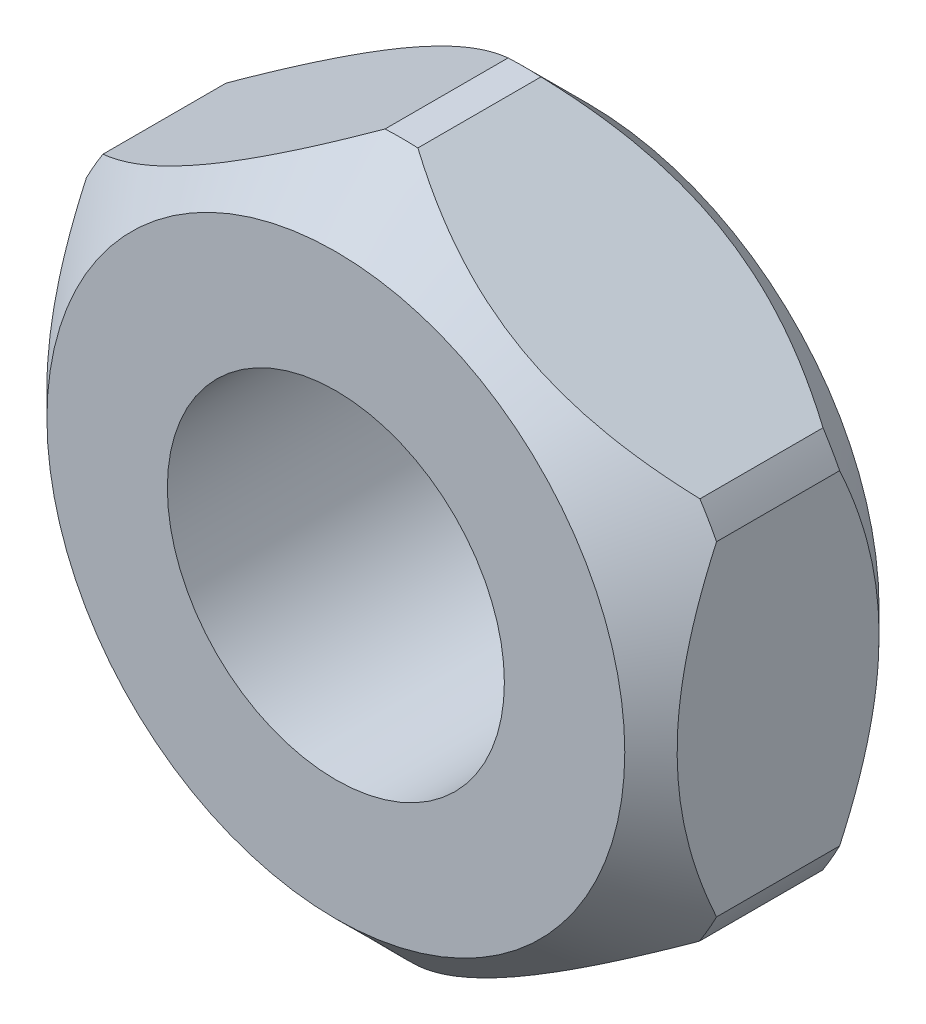
ISO-10303-21;
HEADER;
FILE_DESCRIPTION(('STEP AP214'),'2;1');
FILE_NAME('part.step','',(''),(''),'','','');
FILE_SCHEMA(('AUTOMOTIVE_DESIGN { 1 0 10303 214 1 1 1 1 }'));
ENDSEC;
DATA;
#1=APPLICATION_CONTEXT('core data for automotive mechanical design processes');
#2=APPLICATION_PROTOCOL_DEFINITION('international standard','automotive_design',2000,#1);
#3=PRODUCT_CONTEXT('',#1,'mechanical');
#4=PRODUCT('Part','Part','',(#3));
#5=PRODUCT_RELATED_PRODUCT_CATEGORY('part','',(#4));
#6=PRODUCT_DEFINITION_FORMATION('','',#4);
#7=PRODUCT_DEFINITION_CONTEXT('part definition',#1,'design');
#8=PRODUCT_DEFINITION('design','',#6,#7);
#9=PRODUCT_DEFINITION_SHAPE('','',#8);
#10=(LENGTH_UNIT() NAMED_UNIT(*) SI_UNIT(.MILLI.,.METRE.));
#11=(NAMED_UNIT(*) PLANE_ANGLE_UNIT() SI_UNIT($,.RADIAN.));
#12=(NAMED_UNIT(*) SI_UNIT($,.STERADIAN.) SOLID_ANGLE_UNIT());
#13=UNCERTAINTY_MEASURE_WITH_UNIT(LENGTH_MEASURE(1.E-05),#10,'distance_accuracy_value','');
#14=(GEOMETRIC_REPRESENTATION_CONTEXT(3) GLOBAL_UNCERTAINTY_ASSIGNED_CONTEXT((#13)) GLOBAL_UNIT_ASSIGNED_CONTEXT((#10,
#11,#12)) REPRESENTATION_CONTEXT('',''));
#15=CARTESIAN_POINT('',(0.,0.,0.));
#16=DIRECTION('',(0.,0.,1.));
#17=DIRECTION('',(1.,0.,0.));
#18=AXIS2_PLACEMENT_3D('',#15,#16,#17);
#19=CARTESIAN_POINT('',(-2.54001186026356E-13,-4.00486071307779E-12,-4.0504886494919));
#20=DIRECTION('',(0.,0.,1.));
#21=DIRECTION('',(1.,0.,0.));
#22=AXIS2_PLACEMENT_3D('',#19,#20,#21);
#23=CYLINDRICAL_SURFACE('',#22,7.14438473884469);
#24=DIRECTION('',(0.,0.,-1.));
#25=VECTOR('',#24,1.);
#26=CARTESIAN_POINT('',(0.347952146944708,-7.13590657170695,-2.56216466532603));
#27=LINE('',#26,#25);
#28=CARTESIAN_POINT('',(0.347952146944708,-7.13590657170695,-1.32189467852113));
#29=VERTEX_POINT('',#28);
#30=CARTESIAN_POINT('',(0.347952146944708,-7.13590657170695,-3.80243465213093));
#31=VERTEX_POINT('',#30);
#32=EDGE_CURVE('E112',#29,#31,#27,.T.);
#33=ORIENTED_EDGE('',*,*,#32,.F.);
#34=CARTESIAN_POINT('',(-2.54001186026356E-13,-4.00486071307779E-12,-1.32189467852113));
#35=DIRECTION('',(0.,0.,-1.));
#36=DIRECTION('',(-1.,0.,0.));
#37=AXIS2_PLACEMENT_3D('',#34,#35,#36);
#38=CIRCLE('',#37,7.14438473884469);
#39=CARTESIAN_POINT('',(-0.347952146945216,-7.13590657170695,-1.32189467852114));
#40=VERTEX_POINT('',#39);
#41=EDGE_CURVE('E107',#29,#40,#38,.T.);
#42=ORIENTED_EDGE('',*,*,#41,.T.);
#43=DIRECTION('',(0.,0.,1.));
#44=VECTOR('',#43,1.);
#45=CARTESIAN_POINT('',(-0.347952146945216,-7.13590657170695,-2.56216466532603));
#46=LINE('',#45,#44);
#47=CARTESIAN_POINT('',(-0.347952146945216,-7.13590657170695,-3.80243465213092));
#48=VERTEX_POINT('',#47);
#49=EDGE_CURVE('E109',#48,#40,#46,.T.);
#50=ORIENTED_EDGE('',*,*,#49,.F.);
#51=CARTESIAN_POINT('',(-2.54001186026356E-13,-4.00486071307779E-12,-3.8024346521312));
#52=DIRECTION('',(0.,0.,1.));
#53=DIRECTION('',(0.,-1.,0.));
#54=AXIS2_PLACEMENT_3D('',#51,#52,#53);
#55=CIRCLE('',#54,7.14438473884469);
#56=EDGE_CURVE('E118',#48,#31,#55,.T.);
#57=ORIENTED_EDGE('',*,*,#56,.T.);
#58=EDGE_LOOP('',(#33,#42,#50,#57));
#59=FACE_BOUND('',#58,.T.);
#60=ADVANCED_FACE('F16',(#59),#23,.T.);
#61=CARTESIAN_POINT('',(-2.24698515849874E-11,-1.11931775502268E-11,-4.0504886494919));
#62=DIRECTION('',(0.,0.,1.));
#63=DIRECTION('',(1.,0.,0.));
#64=AXIS2_PLACEMENT_3D('',#61,#62,#63);
#65=CYLINDRICAL_SURFACE('',#64,7.14438473882359);
#66=DIRECTION('',(0.,0.,-1.));
#67=VECTOR('',#66,1.);
#68=CARTESIAN_POINT('',(-6.0059002966524,-3.86928868441782,-2.56216466532603));
#69=LINE('',#68,#67);
#70=CARTESIAN_POINT('',(-6.00590029665232,-3.86928868441787,-1.3218946785211));
#71=VERTEX_POINT('',#70);
#72=CARTESIAN_POINT('',(-6.00590029665232,-3.86928868441787,-3.80243465213096));
#73=VERTEX_POINT('',#72);
#74=EDGE_CURVE('E126',#71,#73,#69,.T.);
#75=ORIENTED_EDGE('',*,*,#74,.F.);
#76=CARTESIAN_POINT('',(-2.24698515849874E-11,-1.11931775502268E-11,-1.32189467852113));
#77=DIRECTION('',(0.,0.,-1.));
#78=DIRECTION('',(-1.,0.,0.));
#79=AXIS2_PLACEMENT_3D('',#76,#77,#78);
#80=CIRCLE('',#79,7.14438473882359);
#81=CARTESIAN_POINT('',(-6.35,-3.2741003797522,-1.32189467852109));
#82=VERTEX_POINT('',#81);
#83=EDGE_CURVE('E133',#71,#82,#80,.T.);
#84=ORIENTED_EDGE('',*,*,#83,.T.);
#85=DIRECTION('',(0.,0.,1.));
#86=VECTOR('',#85,1.);
#87=CARTESIAN_POINT('',(-6.35,-3.27410037975211,-2.56216466532616));
#88=LINE('',#87,#86);
#89=CARTESIAN_POINT('',(-6.35,-3.2741003797522,-3.80243465213097));
#90=VERTEX_POINT('',#89);
#91=EDGE_CURVE('E162',#90,#82,#88,.T.);
#92=ORIENTED_EDGE('',*,*,#91,.F.);
#93=CARTESIAN_POINT('',(-2.24698515849874E-11,-1.11931775502268E-11,-3.80243465213121));
#94=DIRECTION('',(0.,0.,1.));
#95=DIRECTION('',(1.,0.,0.));
#96=AXIS2_PLACEMENT_3D('',#93,#94,#95);
#97=CIRCLE('',#96,7.14438473882359);
#98=EDGE_CURVE('E117',#90,#73,#97,.T.);
#99=ORIENTED_EDGE('',*,*,#98,.T.);
#100=EDGE_LOOP('',(#75,#84,#92,#99));
#101=FACE_BOUND('',#100,.T.);
#102=ADVANCED_FACE('F302',(#101),#65,.T.);
#103=CARTESIAN_POINT('',(-5.41875078794183E-11,3.08629339820814E-11,-4.0504886494919));
#104=DIRECTION('',(0.,0.,1.));
#105=DIRECTION('',(1.,0.,0.));
#106=AXIS2_PLACEMENT_3D('',#103,#104,#105);
#107=CYLINDRICAL_SURFACE('',#106,7.14438473878634);
#108=DIRECTION('',(0.,0.,-1.));
#109=VECTOR('',#108,1.);
#110=CARTESIAN_POINT('',(-6.35,3.27410037975211,-2.56216466532616));
#111=LINE('',#110,#109);
#112=CARTESIAN_POINT('',(-6.35,3.27410037975215,-1.32189467852109));
#113=VERTEX_POINT('',#112);
#114=CARTESIAN_POINT('',(-6.35,3.27410037975215,-3.80243465213097));
#115=VERTEX_POINT('',#114);
#116=EDGE_CURVE('E159',#113,#115,#111,.T.);
#117=ORIENTED_EDGE('',*,*,#116,.F.);
#118=CARTESIAN_POINT('',(-5.41875078794183E-11,3.08629339820814E-11,-1.32189467852113));
#119=DIRECTION('',(0.,0.,-1.));
#120=DIRECTION('',(-1.,0.,0.));
#121=AXIS2_PLACEMENT_3D('',#118,#119,#120);
#122=CIRCLE('',#121,7.14438473878634);
#123=CARTESIAN_POINT('',(-6.01498921798223,3.85514435582517,-1.32189467852111));
#124=VERTEX_POINT('',#123);
#125=EDGE_CURVE('E182',#113,#124,#122,.T.);
#126=ORIENTED_EDGE('',*,*,#125,.T.);
#127=DIRECTION('',(0.,0.,1.));
#128=VECTOR('',#127,1.);
#129=CARTESIAN_POINT('',(-6.01498921798227,3.85514435582515,-2.56216466532603));
#130=LINE('',#129,#128);
#131=CARTESIAN_POINT('',(-6.01498921798223,3.85514435582517,-3.80243465213095));
#132=VERTEX_POINT('',#131);
#133=EDGE_CURVE('E156',#132,#124,#130,.T.);
#134=ORIENTED_EDGE('',*,*,#133,.F.);
#135=CARTESIAN_POINT('',(-5.41875078794183E-11,3.08629339820814E-11,-3.80243465213122));
#136=DIRECTION('',(0.,0.,1.));
#137=DIRECTION('',(1.,0.,0.));
#138=AXIS2_PLACEMENT_3D('',#135,#136,#137);
#139=CIRCLE('',#138,7.14438473878634);
#140=EDGE_CURVE('E183',#132,#115,#139,.T.);
#141=ORIENTED_EDGE('',*,*,#140,.T.);
#142=EDGE_LOOP('',(#117,#126,#134,#141));
#143=FACE_BOUND('',#142,.T.);
#144=ADVANCED_FACE('F309',(#143),#107,.T.);
#145=CARTESIAN_POINT('',(-3.53161261901163E-12,-5.55590515796998E-11,-4.0504886494919));
#146=DIRECTION('',(0.,0.,1.));
#147=DIRECTION('',(1.,0.,0.));
#148=AXIS2_PLACEMENT_3D('',#145,#146,#147);
#149=CYLINDRICAL_SURFACE('',#148,7.14438473890418);
#150=DIRECTION('',(0.,0.,1.));
#151=VECTOR('',#150,1.);
#152=CARTESIAN_POINT('',(0.331158338410472,7.1367056441746,-2.56216466532603));
#153=LINE('',#152,#151);
#154=CARTESIAN_POINT('',(0.331158338410524,7.13670564417457,-3.80243465213099));
#155=VERTEX_POINT('',#154);
#156=CARTESIAN_POINT('',(0.331158338410524,7.13670564417457,-1.32189467852107));
#157=VERTEX_POINT('',#156);
#158=EDGE_CURVE('E150',#155,#157,#153,.T.);
#159=ORIENTED_EDGE('',*,*,#158,.F.);
#160=CARTESIAN_POINT('',(-3.53161261901163E-12,-5.55590515796998E-11,-3.80243465213093));
#161=DIRECTION('',(0.,0.,1.));
#162=DIRECTION('',(1.,0.,0.));
#163=AXIS2_PLACEMENT_3D('',#160,#161,#162);
#164=CIRCLE('',#163,7.14438473890418);
#165=CARTESIAN_POINT('',(-0.33115833840942,7.13670564417476,-3.802434652131));
#166=VERTEX_POINT('',#165);
#167=EDGE_CURVE('E177',#155,#166,#164,.T.);
#168=ORIENTED_EDGE('',*,*,#167,.T.);
#169=DIRECTION('',(0.,0.,-1.));
#170=VECTOR('',#169,1.);
#171=CARTESIAN_POINT('',(-0.33115833840971,7.1367056441746,-2.56216466532603));
#172=LINE('',#171,#170);
#173=CARTESIAN_POINT('',(-0.33115833840942,7.13670564417476,-1.32189467852106));
#174=VERTEX_POINT('',#173);
#175=EDGE_CURVE('E153',#174,#166,#172,.T.);
#176=ORIENTED_EDGE('',*,*,#175,.F.);
#177=CARTESIAN_POINT('',(-3.53161261901163E-12,-5.55590515796998E-11,-1.32189467852113));
#178=DIRECTION('',(0.,0.,-1.));
#179=DIRECTION('',(-1.,0.,0.));
#180=AXIS2_PLACEMENT_3D('',#177,#178,#179);
#181=CIRCLE('',#180,7.14438473890418);
#182=EDGE_CURVE('E180',#174,#157,#181,.T.);
#183=ORIENTED_EDGE('',*,*,#182,.T.);
#184=EDGE_LOOP('',(#159,#168,#176,#183));
#185=FACE_BOUND('',#184,.T.);
#186=ADVANCED_FACE('F313',(#185),#149,.T.);
#187=CARTESIAN_POINT('',(-4.79247923304912E-11,-2.41915466354443E-11,-4.0504886494919));
#188=DIRECTION('',(0.,0.,1.));
#189=DIRECTION('',(1.,0.,0.));
#190=AXIS2_PLACEMENT_3D('',#187,#188,#189);
#191=CYLINDRICAL_SURFACE('',#190,7.14438473890218);
#192=DIRECTION('',(0.,0.,-1.));
#193=VECTOR('',#192,1.);
#194=CARTESIAN_POINT('',(6.01498921797642,3.8551443558343,-2.56216466532603));
#195=LINE('',#194,#193);
#196=CARTESIAN_POINT('',(6.01498921797653,3.85514435583424,-1.32189467852112));
#197=VERTEX_POINT('',#196);
#198=CARTESIAN_POINT('',(6.01498921797653,3.85514435583424,-3.80243465213094));
#199=VERTEX_POINT('',#198);
#200=EDGE_CURVE('E145',#197,#199,#195,.T.);
#201=ORIENTED_EDGE('',*,*,#200,.F.);
#202=CARTESIAN_POINT('',(-4.79247923304912E-11,-2.41915466354443E-11,-1.32189467852113));
#203=DIRECTION('',(0.,0.,-1.));
#204=DIRECTION('',(-1.,0.,0.));
#205=AXIS2_PLACEMENT_3D('',#202,#203,#204);
#206=CIRCLE('',#205,7.14438473890218);
#207=CARTESIAN_POINT('',(6.35,3.27410037975199,-1.32189467852109));
#208=VERTEX_POINT('',#207);
#209=EDGE_CURVE('E175',#197,#208,#206,.T.);
#210=ORIENTED_EDGE('',*,*,#209,.T.);
#211=DIRECTION('',(0.,0.,1.));
#212=VECTOR('',#211,1.);
#213=CARTESIAN_POINT('',(6.35,3.27410037975211,-2.56216466532616));
#214=LINE('',#213,#212);
#215=CARTESIAN_POINT('',(6.35,3.27410037975199,-3.80243465213097));
#216=VERTEX_POINT('',#215);
#217=EDGE_CURVE('E139',#216,#208,#214,.T.);
#218=ORIENTED_EDGE('',*,*,#217,.F.);
#219=CARTESIAN_POINT('',(-4.79247923304912E-11,-2.41915466354443E-11,-3.80243465213093));
#220=DIRECTION('',(0.,0.,1.));
#221=DIRECTION('',(1.,0.,0.));
#222=AXIS2_PLACEMENT_3D('',#219,#220,#221);
#223=CIRCLE('',#222,7.14438473890218);
#224=EDGE_CURVE('E40',#216,#199,#223,.T.);
#225=ORIENTED_EDGE('',*,*,#224,.T.);
#226=EDGE_LOOP('',(#201,#210,#218,#225));
#227=FACE_BOUND('',#226,.T.);
#228=ADVANCED_FACE('F296',(#227),#191,.T.);
#229=CARTESIAN_POINT('',(-8.33117530007804E-12,6.14964183854547E-12,-4.0504886494919));
#230=DIRECTION('',(0.,0.,1.));
#231=DIRECTION('',(1.,0.,0.));
#232=AXIS2_PLACEMENT_3D('',#229,#230,#231);
#233=CYLINDRICAL_SURFACE('',#232,7.14438473885894);
#234=DIRECTION('',(0.,0.,-1.));
#235=VECTOR('',#234,1.);
#236=CARTESIAN_POINT('',(6.35,-3.27410037975236,-2.56216466532616));
#237=LINE('',#236,#235);
#238=CARTESIAN_POINT('',(6.35,-3.27410037975236,-1.32189467852115));
#239=VERTEX_POINT('',#238);
#240=CARTESIAN_POINT('',(6.35,-3.27410037975236,-3.80243465213091));
#241=VERTEX_POINT('',#240);
#242=EDGE_CURVE('E136',#239,#241,#237,.T.);
#243=ORIENTED_EDGE('',*,*,#242,.F.);
#244=CARTESIAN_POINT('',(-8.33117530007804E-12,6.14964183854547E-12,-1.32189467852113));
#245=DIRECTION('',(0.,0.,-1.));
#246=DIRECTION('',(-1.,0.,0.));
#247=AXIS2_PLACEMENT_3D('',#244,#245,#246);
#248=CIRCLE('',#247,7.14438473885894);
#249=CARTESIAN_POINT('',(6.00590029665813,-3.86928868440899,-1.32189467852115));
#250=VERTEX_POINT('',#249);
#251=EDGE_CURVE('E170',#239,#250,#248,.T.);
#252=ORIENTED_EDGE('',*,*,#251,.T.);
#253=DIRECTION('',(0.,0.,1.));
#254=VECTOR('',#253,1.);
#255=CARTESIAN_POINT('',(6.00590029665824,-3.86928868440893,-2.56216466532603));
#256=LINE('',#255,#254);
#257=CARTESIAN_POINT('',(6.00590029665813,-3.86928868440899,-3.80243465213091));
#258=VERTEX_POINT('',#257);
#259=EDGE_CURVE('E167',#258,#250,#256,.T.);
#260=ORIENTED_EDGE('',*,*,#259,.F.);
#261=CARTESIAN_POINT('',(-8.33117530007804E-12,6.14964183854547E-12,-3.80243465213065));
#262=DIRECTION('',(0.,0.,1.));
#263=DIRECTION('',(1.,0.,0.));
#264=AXIS2_PLACEMENT_3D('',#261,#262,#263);
#265=CIRCLE('',#264,7.14438473885894);
#266=EDGE_CURVE('E172',#258,#241,#265,.T.);
#267=ORIENTED_EDGE('',*,*,#266,.T.);
#268=EDGE_LOOP('',(#243,#252,#260,#267));
#269=FACE_BOUND('',#268,.T.);
#270=ADVANCED_FACE('F241',(#269),#233,.T.);
#271=CARTESIAN_POINT('',(0.347952146944708,-7.13590657170695,-4.65936090946275));
#272=DIRECTION('',(0.499999999999997,-0.866025403784441,0.));
#273=DIRECTION('',(0.866025403784441,0.499999999999997,0.));
#274=AXIS2_PLACEMENT_3D('',#271,#272,#273);
#275=PLANE('',#274);
#276=ORIENTED_EDGE('',*,*,#32,.T.);
#277=CARTESIAN_POINT('',(6.00590029665825,-3.86928868440893,-3.80243465213089));
#278=CARTESIAN_POINT('',(5.80644449967036,-3.98444454249131,-3.90770247960772));
#279=CARTESIAN_POINT('',(5.60385786196578,-4.10140799230428,-4.0058942073424));
#280=CARTESIAN_POINT('',(5.19183579420594,-4.33928904403748,-4.18400909526314));
#281=CARTESIAN_POINT('',(4.98237538970745,-4.46022106495926,-4.26385459830314));
#282=CARTESIAN_POINT('',(4.56040344685427,-4.703846679756,-4.3993362422309));
#283=CARTESIAN_POINT('',(4.347965428369,-4.82649782691458,-4.45526956910966));
#284=CARTESIAN_POINT('',(3.91934303659074,-5.07396308018846,-4.54001603066456));
#285=CARTESIAN_POINT('',(3.70316570596371,-5.19877312021867,-4.56887546886592));
#286=CARTESIAN_POINT('',(3.28621233899616,-5.4395012588769,-4.59590188901952));
#287=CARTESIAN_POINT('',(3.08554446084284,-5.55535691234643,-4.59627902924287));
#288=CARTESIAN_POINT('',(2.68527896860236,-5.78645030203879,-4.57183446254958));
#289=CARTESIAN_POINT('',(2.48568197517419,-5.90168767992398,-4.54699945807256));
#290=CARTESIAN_POINT('',(2.08977359237391,-6.13026549130815,-4.47408360389368));
#291=CARTESIAN_POINT('',(1.89346222333125,-6.24360591306992,-4.42600261041476));
#292=CARTESIAN_POINT('',(1.50533134872441,-6.46769337800497,-4.30978956376296));
#293=CARTESIAN_POINT('',(1.31351367590617,-6.57843936304191,-4.24164947809793));
#294=CARTESIAN_POINT('',(0.99217881056966,-6.76396213404396,-4.11197098711162));
#295=CARTESIAN_POINT('',(0.861351786406531,-6.83949515166182,-4.0546602141036));
#296=CARTESIAN_POINT('',(0.602613131566253,-6.98887798368361,-3.93332877512898));
#297=CARTESIAN_POINT('',(0.47469245110724,-7.06273302298154,-3.86933391803887));
#298=CARTESIAN_POINT('',(0.347952146944723,-7.13590657170695,-3.80243465213094));
#299=B_SPLINE_CURVE_WITH_KNOTS('',3,(#277,#278,#279,#280,#281,#282,#283,#284,#285,#286,#287,
#288,#289,#290,#291,#292,#293,#294,#295,#296,#297,#298),.UNSPECIFIED.,.F.,.F.,(4,2,2,2,2,2,2,2,
2,2,4),(0.,0.760090379563456,1.52334116749001,2.27680898244764,3.02898580583094,
3.72273033691908,4.41684095765001,5.11095587152894,5.8053491167717,6.28990118718948,
6.77264699064844),.UNSPECIFIED.);
#300=EDGE_CURVE('E248',#258,#31,#299,.T.);
#301=ORIENTED_EDGE('',*,*,#300,.F.);
#302=ORIENTED_EDGE('',*,*,#259,.T.);
#303=CARTESIAN_POINT('',(0.347952146944714,-7.13590657170695,-1.32189467852112));
#304=CARTESIAN_POINT('',(0.547407943932592,-7.02075071362457,-1.21662685104429));
#305=CARTESIAN_POINT('',(0.749994581637169,-6.90378726381161,-1.11843512330962));
#306=CARTESIAN_POINT('',(1.162016649397,-6.66590621207841,-0.940320235388892));
#307=CARTESIAN_POINT('',(1.37147705389549,-6.54497419115664,-0.8604747323489));
#308=CARTESIAN_POINT('',(1.79344899674866,-6.3013485763599,-0.724993088421149));
#309=CARTESIAN_POINT('',(2.00588701523392,-6.17869742920132,-0.669059761542392));
#310=CARTESIAN_POINT('',(2.43450940701216,-5.93123217592745,-0.584313299987491));
#311=CARTESIAN_POINT('',(2.65068673763919,-5.80642213589724,-0.555453861786134));
#312=CARTESIAN_POINT('',(3.06764010460673,-5.56569399723902,-0.528427441632534));
#313=CARTESIAN_POINT('',(3.26830798276004,-5.44983834376949,-0.528050301409192));
#314=CARTESIAN_POINT('',(3.66857347500052,-5.21874495407714,-0.552494868102476));
#315=CARTESIAN_POINT('',(3.86817046842869,-5.10350757619194,-0.577329872579505));
#316=CARTESIAN_POINT('',(4.26407885122896,-4.87492976480778,-0.65024572675838));
#317=CARTESIAN_POINT('',(4.46039022027162,-4.76158934304602,-0.698326720237302));
#318=CARTESIAN_POINT('',(4.84852109487845,-4.53750187811096,-0.814539766889099));
#319=CARTESIAN_POINT('',(5.04033876769669,-4.42675589307403,-0.882679852554126));
#320=CARTESIAN_POINT('',(5.36167363303321,-4.24123312207197,-1.01235834354044));
#321=CARTESIAN_POINT('',(5.49250065719636,-4.1657001044541,-1.06966911654847));
#322=CARTESIAN_POINT('',(5.75123931203668,-4.01631727243229,-1.19100055552311));
#323=CARTESIAN_POINT('',(5.87915999249571,-3.94246223313434,-1.25499541261324));
#324=CARTESIAN_POINT('',(6.00590029665824,-3.86928868440893,-1.32189467852117));
#325=B_SPLINE_CURVE_WITH_KNOTS('',3,(#303,#304,#305,#306,#307,#308,#309,#310,#311,#312,#313,
#314,#315,#316,#317,#318,#319,#320,#321,#322,#323,#324),.UNSPECIFIED.,.F.,.F.,(4,2,2,2,2,2,2,2,
2,2,4),(0.,0.760090379563435,1.52334116748997,2.27680898244757,3.02898580583085,
3.72273033691898,4.41684095764989,5.11095587152882,5.80534911677157,6.28990118718942,
6.77264699064844),.UNSPECIFIED.);
#326=EDGE_CURVE('E135',#29,#250,#325,.T.);
#327=ORIENTED_EDGE('',*,*,#326,.F.);
#328=EDGE_LOOP('',(#276,#301,#302,#327));
#329=FACE_BOUND('',#328,.T.);
#330=ADVANCED_FACE('F237',(#329),#275,.T.);
#331=CARTESIAN_POINT('',(-6.0059002966524,-3.86928868441782,-4.65936090945995));
#332=DIRECTION('',(-0.499999999999397,-0.866025403784787,0.));
#333=DIRECTION('',(0.866025403784787,-0.499999999999397,0.));
#334=AXIS2_PLACEMENT_3D('',#331,#332,#333);
#335=PLANE('',#334);
#336=ORIENTED_EDGE('',*,*,#74,.T.);
#337=CARTESIAN_POINT('',(-0.347952146945256,-7.13590657170693,-3.80243465213093));
#338=CARTESIAN_POINT('',(-0.547407943933028,-7.02075071362479,-3.90770247960751));
#339=CARTESIAN_POINT('',(-0.749994581637496,-6.90378726381209,-4.00589420734193));
#340=CARTESIAN_POINT('',(-1.16201664939709,-6.6659062120794,-4.18400909526217));
#341=CARTESIAN_POINT('',(-1.37147705389545,-6.5449741911579,-4.26385459830192));
#342=CARTESIAN_POINT('',(-1.79344899674836,-6.3013485763617,-4.39933624222925));
#343=CARTESIAN_POINT('',(-2.00588701523348,-6.1786974292034,-4.45526956910782));
#344=CARTESIAN_POINT('',(-2.43450940701144,-5.93123217593009,-4.54001603066239));
#345=CARTESIAN_POINT('',(-2.65068673763832,-5.80642213590016,-4.56887546886362));
#346=CARTESIAN_POINT('',(-3.06764010460568,-5.56569399724243,-4.59590188901704));
#347=CARTESIAN_POINT('',(-3.26830798275895,-5.44983834377311,-4.59627902924032));
#348=CARTESIAN_POINT('',(-3.66857347499936,-5.21874495408117,-4.57183446254695));
#349=CARTESIAN_POINT('',(-3.86817046842749,-5.10350757619618,-4.5469994580699));
#350=CARTESIAN_POINT('',(-4.26407885122768,-4.87492976481243,-4.47408360389102));
#351=CARTESIAN_POINT('',(-4.4603902202703,-4.76158934305087,-4.42600261041211));
#352=CARTESIAN_POINT('',(-4.84852109487706,-4.53750187811622,-4.30978956376038));
#353=CARTESIAN_POINT('',(-5.04033876769526,-4.42675589307948,-4.24164947809541));
#354=CARTESIAN_POINT('',(-5.36167363303099,-4.24123312207818,-4.11197098710949));
#355=CARTESIAN_POINT('',(-5.49250065719339,-4.16570010446086,-4.05466021410185));
#356=CARTESIAN_POINT('',(-5.75123931203225,-4.01631727244012,-3.93332877512807));
#357=CARTESIAN_POINT('',(-5.87915999249057,-3.94246223314271,-3.86933391803842));
#358=CARTESIAN_POINT('',(-6.00590029665241,-3.86928868441782,-3.80243465213098));
#359=B_SPLINE_CURVE_WITH_KNOTS('',3,(#337,#338,#339,#340,#341,#342,#343,#344,#345,#346,#347,
#348,#349,#350,#351,#352,#353,#354,#355,#356,#357,#358),.UNSPECIFIED.,.F.,.F.,(4,2,2,2,2,2,2,2,
2,2,4),(0.,0.760090379562536,1.52334116748815,2.2768089824449,3.02898580582732,3.72273033691505,
4.41684095764557,5.11095587152409,5.80534911676643,6.28990118718128,6.77264699063732),.UNSPECIFIED.);
#360=EDGE_CURVE('E125',#48,#73,#359,.T.);
#361=ORIENTED_EDGE('',*,*,#360,.F.);
#362=ORIENTED_EDGE('',*,*,#49,.T.);
#363=CARTESIAN_POINT('',(-6.00590029665242,-3.86928868441781,-1.32189467852109));
#364=CARTESIAN_POINT('',(-5.80644449966465,-3.98444454249994,-1.21662685104451));
#365=CARTESIAN_POINT('',(-5.60385786196019,-4.10140799231265,-1.1184351233101));
#366=CARTESIAN_POINT('',(-5.1918357942006,-4.33928904404533,-0.940320235389865));
#367=CARTESIAN_POINT('',(-4.98237538970225,-4.46022106496683,-0.860474732350111));
#368=CARTESIAN_POINT('',(-4.56040344684935,-4.70384667976302,-0.724993088422792));
#369=CARTESIAN_POINT('',(-4.34796542836423,-4.82649782692132,-0.66905976154423));
#370=CARTESIAN_POINT('',(-3.91934303658628,-5.07396308019463,-0.58431329998966));
#371=CARTESIAN_POINT('',(-3.70316570595941,-5.19877312022455,-0.55545386178844));
#372=CARTESIAN_POINT('',(-3.28621233899206,-5.43950125888228,-0.528427441635021));
#373=CARTESIAN_POINT('',(-3.08554446083879,-5.55535691235159,-0.528050301411744));
#374=CARTESIAN_POINT('',(-2.68527896859839,-5.78645030204353,-0.552494868105114));
#375=CARTESIAN_POINT('',(-2.48568197517026,-5.90168767992852,-0.577329872582164));
#376=CARTESIAN_POINT('',(-2.08977359237007,-6.13026549131227,-0.650245726761044));
#377=CARTESIAN_POINT('',(-1.89346222332746,-6.24360591307382,-0.698326720239948));
#378=CARTESIAN_POINT('',(-1.50533134872071,-6.46769337800847,-0.814539766891677));
#379=CARTESIAN_POINT('',(-1.31351367590251,-6.57843936304521,-0.882679852556652));
#380=CARTESIAN_POINT('',(-0.992178810566758,-6.76396213404652,-1.01235834354257));
#381=CARTESIAN_POINT('',(-0.861351786404338,-6.83949515166385,-1.06966911655022));
#382=CARTESIAN_POINT('',(-0.602613131565443,-6.98887798368461,-1.19100055552402));
#383=CARTESIAN_POINT('',(-0.474692451107105,-7.06273302298203,-1.25499541261368));
#384=CARTESIAN_POINT('',(-0.347952146945249,-7.13590657170694,-1.32189467852113));
#385=B_SPLINE_CURVE_WITH_KNOTS('',3,(#363,#364,#365,#366,#367,#368,#369,#370,#371,#372,#373,
#374,#375,#376,#377,#378,#379,#380,#381,#382,#383,#384),.UNSPECIFIED.,.F.,.F.,(4,2,2,2,2,2,2,2,
2,2,4),(0.,0.760090379562518,1.52334116748811,2.27680898244484,3.02898580582724,
3.72273033691497,4.41684095764547,5.11095587152398,5.80534911676631,6.28990118718123,
6.77264699063735),.UNSPECIFIED.);
#386=EDGE_CURVE('E20',#71,#40,#385,.T.);
#387=ORIENTED_EDGE('',*,*,#386,.F.);
#388=EDGE_LOOP('',(#336,#361,#362,#387));
#389=FACE_BOUND('',#388,.T.);
#390=ADVANCED_FACE('F123',(#389),#335,.T.);
#391=CARTESIAN_POINT('',(-6.35,-3.27410037975211,-4.62123524768755));
#392=DIRECTION('',(-1.,0.,0.));
#393=DIRECTION('',(0.,0.,1.));
#394=AXIS2_PLACEMENT_3D('',#391,#392,#393);
#395=PLANE('',#394);
#396=CARTESIAN_POINT('',(-6.35,-3.27410037975216,-3.80243465213098));
#397=CARTESIAN_POINT('',(-6.35,-3.04440220194523,-3.90764829564453));
#398=CARTESIAN_POINT('',(-6.35,-2.81114584027907,-4.00584458909035));
#399=CARTESIAN_POINT('',(-6.35,-2.3365849945459,-4.18417680231032));
#400=CARTESIAN_POINT('',(-6.35,-2.09524680516606,-4.26422229729192));
#401=CARTESIAN_POINT('',(-6.35,-1.60711200527346,-4.40075606287305));
#402=CARTESIAN_POINT('',(-6.35,-1.36035043795745,-4.457365047468));
#403=CARTESIAN_POINT('',(-6.35,-0.987018301047145,-4.5217399792804));
#404=CARTESIAN_POINT('',(-6.35,-0.862163697797326,-4.53976773257629));
#405=CARTESIAN_POINT('',(-6.35,-0.611637849149564,-4.56864164266215));
#406=CARTESIAN_POINT('',(-6.35,-0.485966842792028,-4.57948981367409));
#407=CARTESIAN_POINT('',(-6.35,-0.300141236453309,-4.5900124374139));
#408=CARTESIAN_POINT('',(-6.35,-0.240137463711302,-4.59256334282455));
#409=CARTESIAN_POINT('',(-6.35,-0.120091567216306,-4.59596760977057));
#410=CARTESIAN_POINT('',(-6.35,-0.060049449649667,-4.59682119779166));
#411=CARTESIAN_POINT('',(-6.35,0.19279097526235,-4.59681359014282));
#412=CARTESIAN_POINT('',(-6.35,0.385657526317529,-4.5879907665782));
#413=CARTESIAN_POINT('',(-6.35,0.769914221397074,-4.55318370591599));
#414=CARTESIAN_POINT('',(-6.35,0.961303163523493,-4.52718673778087));
#415=CARTESIAN_POINT('',(-6.35,1.34192293034289,-4.45928930993105));
#416=CARTESIAN_POINT('',(-6.35,1.53114341051906,-4.41733151344229));
#417=CARTESIAN_POINT('',(-6.35,1.90594350232975,-4.31942441475768));
#418=CARTESIAN_POINT('',(-6.35,2.09152200408887,-4.26347091671015));
#419=CARTESIAN_POINT('',(-6.35,2.44561349040568,-4.14404706256897));
#420=CARTESIAN_POINT('',(-6.35,2.61440454328482,-4.08138926091265));
#421=CARTESIAN_POINT('',(-6.35,2.94738591016352,-3.9477801441052));
#422=CARTESIAN_POINT('',(-6.35,3.11159930870966,-3.87688657374578));
#423=CARTESIAN_POINT('',(-6.35,3.27410037975216,-3.80243465213098));
#424=B_SPLINE_CURVE_WITH_KNOTS('',3,(#396,#397,#398,#399,#400,#401,#402,#403,#404,#405,#406,
#407,#408,#409,#410,#411,#412,#413,#414,#415,#416,#417,#418,#419,#420,#421,#422,#423),
.UNSPECIFIED.,.F.,.F.,(4,2,2,2,2,2,2,2,2,2,2,2,2,4),(0.,0.758284091043983,1.52026668202175,
2.27827419221224,2.65655420866983,3.03472805414866,3.21488070951133,3.39500932414775,
3.9733188921956,4.5520576376477,5.13289535081314,5.71390740579613,6.25378809182721,
6.79008909942399),.UNSPECIFIED.);
#425=EDGE_CURVE('E276',#90,#115,#424,.T.);
#426=ORIENTED_EDGE('',*,*,#425,.F.);
#427=ORIENTED_EDGE('',*,*,#91,.T.);
#428=CARTESIAN_POINT('',(-6.35,3.27410037975221,-1.3218946785211));
#429=CARTESIAN_POINT('',(-6.35,3.04440220194528,-1.21668103500756));
#430=CARTESIAN_POINT('',(-6.35,2.81114584027911,-1.11848474156173));
#431=CARTESIAN_POINT('',(-6.35,2.33658499454595,-0.940152528341757));
#432=CARTESIAN_POINT('',(-6.35,2.09524680516611,-0.860107033360148));
#433=CARTESIAN_POINT('',(-6.35,1.60711200527349,-0.723573267779022));
#434=CARTESIAN_POINT('',(-6.35,1.36035043795748,-0.666964283184066));
#435=CARTESIAN_POINT('',(-6.35,0.987018301047173,-0.602589351371662));
#436=CARTESIAN_POINT('',(-6.35,0.862163697797352,-0.58456159807577));
#437=CARTESIAN_POINT('',(-6.35,0.611637849149586,-0.555687687989914));
#438=CARTESIAN_POINT('',(-6.35,0.485966842792048,-0.544839516977967));
#439=CARTESIAN_POINT('',(-6.35,0.300141236453324,-0.534316893238156));
#440=CARTESIAN_POINT('',(-6.35,0.240137463711314,-0.531765987827511));
#441=CARTESIAN_POINT('',(-6.35,0.120091567216312,-0.528361720881491));
#442=CARTESIAN_POINT('',(-6.35,0.0600494496496699,-0.527508132860398));
#443=CARTESIAN_POINT('',(-6.35,-0.19279097526235,-0.527515740509242));
#444=CARTESIAN_POINT('',(-6.35,-0.385657526317529,-0.536338564073863));
#445=CARTESIAN_POINT('',(-6.35,-0.769914221397074,-0.571145624736067));
#446=CARTESIAN_POINT('',(-6.35,-0.961303163523493,-0.597142592871187));
#447=CARTESIAN_POINT('',(-6.35,-1.34192293034289,-0.665040020721014));
#448=CARTESIAN_POINT('',(-6.35,-1.53114341051906,-0.706997817209771));
#449=CARTESIAN_POINT('',(-6.35,-1.90594350232975,-0.804904915894376));
#450=CARTESIAN_POINT('',(-6.35,-2.09152200408887,-0.860858413941906));
#451=CARTESIAN_POINT('',(-6.35,-2.44561349040569,-0.980282268083093));
#452=CARTESIAN_POINT('',(-6.35,-2.61440454328484,-1.04294006973941));
#453=CARTESIAN_POINT('',(-6.35,-2.94738591016355,-1.17654918654687));
#454=CARTESIAN_POINT('',(-6.35,-3.1115993087097,-1.2474427569063));
#455=CARTESIAN_POINT('',(-6.35,-3.27410037975221,-1.3218946785211));
#456=B_SPLINE_CURVE_WITH_KNOTS('',3,(#428,#429,#430,#431,#432,#433,#434,#435,#436,#437,#438,
#439,#440,#441,#442,#443,#444,#445,#446,#447,#448,#449,#450,#451,#452,#453,#454,#455),
.UNSPECIFIED.,.F.,.F.,(4,2,2,2,2,2,2,2,2,2,2,2,2,4),(0.,0.758284091043991,1.52026668202176,
2.27827419221226,2.65655420866987,3.03472805414869,3.21488070951138,3.3950093241478,
3.97331889219565,4.55205763764776,5.1328953508132,5.71390740579619,6.2537880918273,
6.7900890994241),.UNSPECIFIED.);
#457=EDGE_CURVE('E255',#113,#82,#456,.T.);
#458=ORIENTED_EDGE('',*,*,#457,.F.);
#459=ORIENTED_EDGE('',*,*,#116,.T.);
#460=EDGE_LOOP('',(#426,#427,#458,#459));
#461=FACE_BOUND('',#460,.T.);
#462=ADVANCED_FACE('F269',(#461),#395,.T.);
#463=CARTESIAN_POINT('',(-0.33115833840971,7.1367056441746,-4.6678089756443));
#464=DIRECTION('',(-0.499999999999991,0.866025403784444,0.));
#465=DIRECTION('',(-0.866025403784444,-0.499999999999991,0.));
#466=AXIS2_PLACEMENT_3D('',#463,#464,#465);
#467=PLANE('',#466);
#468=ORIENTED_EDGE('',*,*,#175,.T.);
#469=CARTESIAN_POINT('',(-6.01498921798226,3.85514435582516,-3.80243465213097));
#470=CARTESIAN_POINT('',(-5.81496519097359,3.970628281663,-3.908482369245));
#471=CARTESIAN_POINT('',(-5.61179133060463,4.08793076463932,-4.00744910146816));
#472=CARTESIAN_POINT('',(-5.19852705751666,4.3265290039531,-4.18706143037486));
#473=CARTESIAN_POINT('',(-4.98841106150924,4.44783953080903,-4.26762789919391));
#474=CARTESIAN_POINT('',(-4.56510814807111,4.69223358183128,-4.40441292722398));
#475=CARTESIAN_POINT('',(-4.35199664636562,4.81527356470835,-4.46093435217662));
#476=CARTESIAN_POINT('',(-3.92197105263238,5.06354895700866,-4.54667807323882));
#477=CARTESIAN_POINT('',(-3.7050642184556,5.18878017610969,-4.57594767561063));
#478=CARTESIAN_POINT('',(-3.28702113629001,5.43013746213085,-4.60351488018172));
#479=CARTESIAN_POINT('',(-3.08599798906593,5.54619823029401,-4.60408406472882));
#480=CARTESIAN_POINT('',(-2.68501281148752,5.77770713050995,-4.57989704093889));
#481=CARTESIAN_POINT('',(-2.48505140037594,5.89315490504276,-4.55512740236316));
#482=CARTESIAN_POINT('',(-2.0884174463618,6.12215162516256,-4.48222076759314));
#483=CARTESIAN_POINT('',(-1.89174503797431,6.23570049308725,-4.43408281807744));
#484=CARTESIAN_POINT('',(-1.50291569805328,6.46019121715947,-4.31766158888135));
#485=CARTESIAN_POINT('',(-1.31076065097436,6.57113198531663,-4.24937005749922));
#486=CARTESIAN_POINT('',(-0.986708658208426,6.75822349057147,-4.1184955972012));
#487=CARTESIAN_POINT('',(-0.853539116109429,6.83510896155018,-4.06002827428421));
#488=CARTESIAN_POINT('',(-0.65595110875603,6.94918645078431,-3.96708674826401));
#489=CARTESIAN_POINT('',(-0.590575830772579,6.9869308851264,-3.93530037938303));
#490=CARTESIAN_POINT('',(-0.460419155703435,7.06207687651439,-3.87007344378611));
#491=CARTESIAN_POINT('',(-0.395637977471105,7.09947830720525,-3.83663229437931));
#492=CARTESIAN_POINT('',(-0.331158338409629,7.13670564417464,-3.80243465213104));
#493=B_SPLINE_CURVE_WITH_KNOTS('',3,(#469,#470,#471,#472,#473,#474,#475,#476,#477,#478,#479,
#480,#481,#482,#483,#484,#485,#486,#487,#488,#489,#490,#491,#492),.UNSPECIFIED.,.F.,.F.,(4,2,2,
2,2,2,2,2,2,2,2,4),(0.,0.76286095053606,1.52894317468713,2.28506775342085,3.03987731978321,
3.73484297668313,4.43017717449618,5.12553974118411,5.82118741373041,6.31452808579812,
6.56023475300041,6.80602856422502),.UNSPECIFIED.);
#494=EDGE_CURVE('E281',#132,#166,#493,.T.);
#495=ORIENTED_EDGE('',*,*,#494,.F.);
#496=ORIENTED_EDGE('',*,*,#133,.T.);
#497=CARTESIAN_POINT('',(-0.331158338409619,7.13670564417465,-1.32189467852103));
#498=CARTESIAN_POINT('',(-0.53118236541828,7.02122171833681,-1.215846961407));
#499=CARTESIAN_POINT('',(-0.734356225787235,6.9039192353605,-1.11688022918385));
#500=CARTESIAN_POINT('',(-1.14762049887519,6.66532099604672,-0.937267900277158));
#501=CARTESIAN_POINT('',(-1.35773649488261,6.54401046919079,-0.85670143145812));
#502=CARTESIAN_POINT('',(-1.78103940832072,6.29961641816855,-0.719916403428063));
#503=CARTESIAN_POINT('',(-1.99415091002621,6.17657643529149,-0.663394978475425));
#504=CARTESIAN_POINT('',(-2.42417650375943,5.92830104299119,-0.577651257413226));
#505=CARTESIAN_POINT('',(-2.6410833379362,5.80306982389016,-0.548381655041422));
#506=CARTESIAN_POINT('',(-3.05912642010178,5.56171253786901,-0.520814450470338));
#507=CARTESIAN_POINT('',(-3.26014956732585,5.44565176970585,-0.52024526592324));
#508=CARTESIAN_POINT('',(-3.66113474490426,5.21414286948991,-0.544432289713173));
#509=CARTESIAN_POINT('',(-3.86109615601583,5.09869509495711,-0.569201928288902));
#510=CARTESIAN_POINT('',(-4.25773011002996,4.86969837483731,-0.642108563058922));
#511=CARTESIAN_POINT('',(-4.45440251841745,4.75614950691263,-0.690246512574618));
#512=CARTESIAN_POINT('',(-4.84323185833847,4.53165878284041,-0.806667741770708));
#513=CARTESIAN_POINT('',(-5.03538690541739,4.42071801468325,-0.874959273152836));
#514=CARTESIAN_POINT('',(-5.35943889818334,4.2336265094284,-1.00583373345086));
#515=CARTESIAN_POINT('',(-5.49260844028236,4.15674103844967,-1.06430105636787));
#516=CARTESIAN_POINT('',(-5.6901964476358,4.04266354921553,-1.15724258238808));
#517=CARTESIAN_POINT('',(-5.75557172561926,4.00491911487343,-1.18902895126906));
#518=CARTESIAN_POINT('',(-5.88572840068843,3.92977312348542,-1.254255886866));
#519=CARTESIAN_POINT('',(-5.95050957892077,3.89237169279456,-1.28769703627281));
#520=CARTESIAN_POINT('',(-6.01498921798226,3.85514435582516,-1.32189467852109));
#521=B_SPLINE_CURVE_WITH_KNOTS('',3,(#497,#498,#499,#500,#501,#502,#503,#504,#505,#506,#507,
#508,#509,#510,#511,#512,#513,#514,#515,#516,#517,#518,#519,#520),.UNSPECIFIED.,.F.,.F.,(4,2,2,
2,2,2,2,2,2,2,2,4),(0.,0.762860950536033,1.52894317468708,2.28506775342077,3.0398773197831,
3.73484297668301,4.43017717449604,5.12553974118395,5.82118741373024,6.31452808579805,
6.56023475300037,6.80602856422503),.UNSPECIFIED.);
#522=EDGE_CURVE('E265',#174,#124,#521,.T.);
#523=ORIENTED_EDGE('',*,*,#522,.F.);
#524=EDGE_LOOP('',(#468,#495,#496,#523));
#525=FACE_BOUND('',#524,.T.);
#526=ADVANCED_FACE('F272',(#525),#467,.T.);
#527=CARTESIAN_POINT('',(6.01498921797642,3.8551443558343,-4.66780897564151));
#528=DIRECTION('',(0.499999999999381,0.866025403784796,0.));
#529=DIRECTION('',(-0.866025403784796,0.499999999999381,0.));
#530=AXIS2_PLACEMENT_3D('',#527,#528,#529);
#531=PLANE('',#530);
#532=ORIENTED_EDGE('',*,*,#200,.T.);
#533=CARTESIAN_POINT('',(0.331158338410451,7.13670564417461,-3.80243465213103));
#534=CARTESIAN_POINT('',(0.531182365418994,7.02122171833702,-3.90848236924479));
#535=CARTESIAN_POINT('',(0.734356225787826,6.90391923536098,-4.00744910146766));
#536=CARTESIAN_POINT('',(1.14762049887551,6.66532099604774,-4.18706143037384));
#537=CARTESIAN_POINT('',(1.35773649488278,6.5440104691921,-4.26762789919262));
#538=CARTESIAN_POINT('',(1.7810394083206,6.29961641817042,-4.40441292722222));
#539=CARTESIAN_POINT('',(1.99415091002594,6.17657643529364,-4.46093435217465));
#540=CARTESIAN_POINT('',(2.42417650375885,5.92830104299393,-4.54667807323651));
#541=CARTESIAN_POINT('',(2.64108333793545,5.8030698238932,-4.57594767560817));
#542=CARTESIAN_POINT('',(3.05912642010082,5.56171253787257,-4.60351488017906));
#543=CARTESIAN_POINT('',(3.26014956732485,5.44565176970962,-4.6040840647261));
#544=CARTESIAN_POINT('',(3.66113474490317,5.21414286949411,-4.57989704093607));
#545=CARTESIAN_POINT('',(3.86109615601469,5.09869509496152,-4.55512740236032));
#546=CARTESIAN_POINT('',(4.25773011002873,4.86969837484215,-4.4822207675903));
#547=CARTESIAN_POINT('',(4.45440251841618,4.75614950691767,-4.43408281807462));
#548=CARTESIAN_POINT('',(4.84323185833711,4.53165878284587,-4.31766158887861));
#549=CARTESIAN_POINT('',(5.03538690541599,4.42071801468891,-4.24937005749654));
#550=CARTESIAN_POINT('',(5.35943889818114,4.23362650943483,-4.11849559719892));
#551=CARTESIAN_POINT('',(5.49260844027941,4.15674103845666,-4.06002827428231));
#552=CARTESIAN_POINT('',(5.69019644763174,4.04266354922334,-3.96708674826276));
#553=CARTESIAN_POINT('',(5.75557172561484,4.00491911488151,-3.935300379382));
#554=CARTESIAN_POINT('',(5.8857284006833,3.92977312349403,-3.87007344378554));
#555=CARTESIAN_POINT('',(5.95050957891528,3.89237169280344,-3.83663229437898));
#556=CARTESIAN_POINT('',(6.01498921797642,3.8551443558343,-3.80243465213095));
#557=B_SPLINE_CURVE_WITH_KNOTS('',3,(#533,#534,#535,#536,#537,#538,#539,#540,#541,#542,#543,
#544,#545,#546,#547,#548,#549,#550,#551,#552,#553,#554,#555,#556),.UNSPECIFIED.,.F.,.F.,(4,2,2,
2,2,2,2,2,2,2,2,4),(0.,0.762860950535061,1.52894317468511,2.28506775341787,3.03987731977928,
3.73484297667876,4.43017717449137,5.12553974117885,5.8211874137247,6.31452808578948,
6.5602347529903,6.80602856421346),.UNSPECIFIED.);
#558=EDGE_CURVE('E204',#155,#199,#557,.T.);
#559=ORIENTED_EDGE('',*,*,#558,.F.);
#560=ORIENTED_EDGE('',*,*,#158,.T.);
#561=CARTESIAN_POINT('',(6.01498921797644,3.85514435583429,-1.32189467852112));
#562=CARTESIAN_POINT('',(5.81496519096789,3.97062828167188,-1.21584696140735));
#563=CARTESIAN_POINT('',(5.61179133059905,4.08793076464793,-1.11688022918447));
#564=CARTESIAN_POINT('',(5.19852705751134,4.32652900396118,-0.937267900278279));
#565=CARTESIAN_POINT('',(4.98841106150406,4.44783953081683,-0.856701431459484));
#566=CARTESIAN_POINT('',(4.56510814806622,4.69223358183852,-0.719916403429867));
#567=CARTESIAN_POINT('',(4.35199664636087,4.8152735647153,-0.663394978477428));
#568=CARTESIAN_POINT('',(3.92197105262795,5.06354895701503,-0.577651257415565));
#569=CARTESIAN_POINT('',(3.70506421845133,5.18878017611576,-0.548381655043899));
#570=CARTESIAN_POINT('',(3.28702113628595,5.4301374621364,-0.520814450472995));
#571=CARTESIAN_POINT('',(3.08599798906191,5.54619823029936,-0.520245265925961));
#572=CARTESIAN_POINT('',(2.68501281148358,5.77770713051487,-0.544432289715982));
#573=CARTESIAN_POINT('',(2.48505140037205,5.89315490504746,-0.569201928291734));
#574=CARTESIAN_POINT('',(2.08841744635799,6.12215162516685,-0.642108563061756));
#575=CARTESIAN_POINT('',(1.89174503797054,6.23570049309132,-0.690246512577432));
#576=CARTESIAN_POINT('',(1.5029156980496,6.46019121716314,-0.80666774177345));
#577=CARTESIAN_POINT('',(1.31076065097071,6.57113198532009,-0.874959273155528));
#578=CARTESIAN_POINT('',(0.986708658205583,6.75822349057417,-1.00583373345313));
#579=CARTESIAN_POINT('',(0.853539116107334,6.83510896155232,-1.06430105636973));
#580=CARTESIAN_POINT('',(0.65595110875503,6.94918645078563,-1.15724258238927));
#581=CARTESIAN_POINT('',(0.590575830771939,6.98693088512745,-1.18902895127002));
#582=CARTESIAN_POINT('',(0.460419155703508,7.06207687651492,-1.25425588686647));
#583=CARTESIAN_POINT('',(0.395637977471531,7.09947830720551,-1.28769703627303));
#584=CARTESIAN_POINT('',(0.331158338410403,7.13670564417464,-1.32189467852105));
#585=B_SPLINE_CURVE_WITH_KNOTS('',3,(#561,#562,#563,#564,#565,#566,#567,#568,#569,#570,#571,
#572,#573,#574,#575,#576,#577,#578,#579,#580,#581,#582,#583,#584),.UNSPECIFIED.,.F.,.F.,(4,2,2,
2,2,2,2,2,2,2,2,4),(0.,0.762860950535101,1.52894317468519,2.28506775341799,3.03987731977944,
3.73484297667894,4.43017717449157,5.12553974117907,5.82118741372494,6.31452808578964,
6.56023475299043,6.80602856421354),.UNSPECIFIED.);
#586=EDGE_CURVE('E228',#197,#157,#585,.T.);
#587=ORIENTED_EDGE('',*,*,#586,.F.);
#588=EDGE_LOOP('',(#532,#559,#560,#587));
#589=FACE_BOUND('',#588,.T.);
#590=ADVANCED_FACE('F217',(#589),#531,.T.);
#591=CARTESIAN_POINT('',(6.35,-3.27410037975236,-4.62123524768755));
#592=DIRECTION('',(1.,0.,0.));
#593=DIRECTION('',(0.,1.,0.));
#594=AXIS2_PLACEMENT_3D('',#591,#592,#593);
#595=PLANE('',#594);
#596=ORIENTED_EDGE('',*,*,#242,.T.);
#597=CARTESIAN_POINT('',(6.35,3.27410037975215,-3.80243465213099));
#598=CARTESIAN_POINT('',(6.35,3.04440220194522,-3.90764829564453));
#599=CARTESIAN_POINT('',(6.35,2.81114584027905,-4.00584458909036));
#600=CARTESIAN_POINT('',(6.35,2.33658499454589,-4.18417680231032));
#601=CARTESIAN_POINT('',(6.35,2.09524680516605,-4.26422229729193));
#602=CARTESIAN_POINT('',(6.35,1.60711200527345,-4.40075606287305));
#603=CARTESIAN_POINT('',(6.35,1.36035043795744,-4.457365047468));
#604=CARTESIAN_POINT('',(6.35,0.987018301047137,-4.5217399792804));
#605=CARTESIAN_POINT('',(6.35,0.862163697797318,-4.53976773257629));
#606=CARTESIAN_POINT('',(6.35,0.611637849149557,-4.56864164266215));
#607=CARTESIAN_POINT('',(6.35,0.485966842792022,-4.57948981367409));
#608=CARTESIAN_POINT('',(6.35,0.300141236453304,-4.5900124374139));
#609=CARTESIAN_POINT('',(6.35,0.240137463711297,-4.59256334282455));
#610=CARTESIAN_POINT('',(6.35,0.120091567216304,-4.59596760977057));
#611=CARTESIAN_POINT('',(6.35,0.0600494496496659,-4.59682119779166));
#612=CARTESIAN_POINT('',(6.35,-0.19279097526235,-4.59681359014282));
#613=CARTESIAN_POINT('',(6.35,-0.385657526317529,-4.5879907665782));
#614=CARTESIAN_POINT('',(6.35,-0.769914221397075,-4.55318370591599));
#615=CARTESIAN_POINT('',(6.35,-0.961303163523493,-4.52718673778087));
#616=CARTESIAN_POINT('',(6.35,-1.34192293034289,-4.45928930993105));
#617=CARTESIAN_POINT('',(6.35,-1.53114341051906,-4.41733151344229));
#618=CARTESIAN_POINT('',(6.35,-1.90594350232975,-4.31942441475768));
#619=CARTESIAN_POINT('',(6.35,-2.09152200408887,-4.26347091671015));
#620=CARTESIAN_POINT('',(6.35,-2.44561349040569,-4.14404706256897));
#621=CARTESIAN_POINT('',(6.35,-2.61440454328484,-4.08138926091264));
#622=CARTESIAN_POINT('',(6.35,-2.94738591016355,-3.94778014410519));
#623=CARTESIAN_POINT('',(6.35,-3.11159930870971,-3.87688657374576));
#624=CARTESIAN_POINT('',(6.35,-3.27410037975222,-3.80243465213095));
#625=B_SPLINE_CURVE_WITH_KNOTS('',3,(#597,#598,#599,#600,#601,#602,#603,#604,#605,#606,#607,
#608,#609,#610,#611,#612,#613,#614,#615,#616,#617,#618,#619,#620,#621,#622,#623,#624),
.UNSPECIFIED.,.F.,.F.,(4,2,2,2,2,2,2,2,2,2,2,2,2,4),(0.,0.758284091043982,1.52026668202174,
2.27827419221223,2.65655420866983,3.03472805414865,3.21488070951132,3.39500932414773,
3.97331889219558,4.55205763764769,5.13289535081313,5.71390740579612,6.25378809182723,
6.79008909942404),.UNSPECIFIED.);
#626=EDGE_CURVE('E197',#216,#241,#625,.T.);
#627=ORIENTED_EDGE('',*,*,#626,.F.);
#628=ORIENTED_EDGE('',*,*,#217,.T.);
#629=CARTESIAN_POINT('',(6.35,-3.27410037975227,-1.32189467852113));
#630=CARTESIAN_POINT('',(6.35,-3.04440220194533,-1.21668103500758));
#631=CARTESIAN_POINT('',(6.35,-2.81114584027916,-1.11848474156175));
#632=CARTESIAN_POINT('',(6.35,-2.33658499454599,-0.94015252834177));
#633=CARTESIAN_POINT('',(6.35,-2.09524680516614,-0.860107033360159));
#634=CARTESIAN_POINT('',(6.35,-1.60711200527352,-0.723573267779029));
#635=CARTESIAN_POINT('',(6.35,-1.36035043795751,-0.666964283184071));
#636=CARTESIAN_POINT('',(6.35,-0.987018301047196,-0.602589351371666));
#637=CARTESIAN_POINT('',(6.35,-0.862163697797374,-0.584561598075773));
#638=CARTESIAN_POINT('',(6.35,-0.611637849149607,-0.555687687989917));
#639=CARTESIAN_POINT('',(6.35,-0.485966842792067,-0.544839516977968));
#640=CARTESIAN_POINT('',(6.35,-0.300141236453339,-0.534316893238157));
#641=CARTESIAN_POINT('',(6.35,-0.240137463711326,-0.531765987827511));
#642=CARTESIAN_POINT('',(6.35,-0.120091567216318,-0.528361720881491));
#643=CARTESIAN_POINT('',(6.35,-0.060049449649673,-0.527508132860398));
#644=CARTESIAN_POINT('',(6.35,0.19279097526235,-0.527515740509243));
#645=CARTESIAN_POINT('',(6.35,0.385657526317529,-0.536338564073863));
#646=CARTESIAN_POINT('',(6.35,0.769914221397074,-0.571145624736067));
#647=CARTESIAN_POINT('',(6.35,0.961303163523493,-0.597142592871187));
#648=CARTESIAN_POINT('',(6.35,1.34192293034289,-0.665040020721014));
#649=CARTESIAN_POINT('',(6.35,1.53114341051906,-0.706997817209771));
#650=CARTESIAN_POINT('',(6.35,1.90594350232975,-0.804904915894376));
#651=CARTESIAN_POINT('',(6.35,2.09152200408887,-0.860858413941906));
#652=CARTESIAN_POINT('',(6.35,2.44561349040569,-0.980282268083092));
#653=CARTESIAN_POINT('',(6.35,2.61440454328483,-1.04294006973941));
#654=CARTESIAN_POINT('',(6.35,2.94738591016354,-1.17654918654686));
#655=CARTESIAN_POINT('',(6.35,3.11159930870969,-1.24744275690629));
#656=CARTESIAN_POINT('',(6.35,3.2741003797522,-1.3218946785211));
#657=B_SPLINE_CURVE_WITH_KNOTS('',3,(#629,#630,#631,#632,#633,#634,#635,#636,#637,#638,#639,
#640,#641,#642,#643,#644,#645,#646,#647,#648,#649,#650,#651,#652,#653,#654,#655,#656),
.UNSPECIFIED.,.F.,.F.,(4,2,2,2,2,2,2,2,2,2,2,2,2,4),(0.,0.758284091044005,1.52026668202179,
2.2782741922123,2.6565542086699,3.03472805414874,3.21488070951143,3.39500932414786,
3.97331889219571,4.55205763764782,5.13289535081326,5.71390740579625,6.25378809182735,
6.79008909942415),.UNSPECIFIED.);
#658=EDGE_CURVE('E137',#239,#208,#657,.T.);
#659=ORIENTED_EDGE('',*,*,#658,.F.);
#660=EDGE_LOOP('',(#596,#627,#628,#659));
#661=FACE_BOUND('',#660,.T.);
#662=ADVANCED_FACE('F214',(#661),#595,.T.);
#663=CARTESIAN_POINT('',(0.,0.,-1.45408414637326));
#664=DIRECTION('',(0.,0.,-1.));
#665=DIRECTION('',(-1.,0.,0.));
#666=AXIS2_PLACEMENT_3D('',#663,#664,#665);
#667=CONICAL_SURFACE('',#666,7.27657420670082,0.785398163397448);
#668=ORIENTED_EDGE('',*,*,#251,.F.);
#669=ORIENTED_EDGE('',*,*,#658,.T.);
#670=ORIENTED_EDGE('',*,*,#209,.F.);
#671=ORIENTED_EDGE('',*,*,#586,.T.);
#672=ORIENTED_EDGE('',*,*,#182,.F.);
#673=ORIENTED_EDGE('',*,*,#522,.T.);
#674=ORIENTED_EDGE('',*,*,#125,.F.);
#675=ORIENTED_EDGE('',*,*,#457,.T.);
#676=ORIENTED_EDGE('',*,*,#83,.F.);
#677=ORIENTED_EDGE('',*,*,#386,.T.);
#678=ORIENTED_EDGE('',*,*,#41,.F.);
#679=ORIENTED_EDGE('',*,*,#326,.T.);
#680=EDGE_LOOP('',(#668,#669,#670,#671,#672,#673,#674,#675,#676,#677,#678,#679));
#681=FACE_BOUND('',#680,.T.);
#682=CARTESIAN_POINT('',(0.,0.,0.));
#683=DIRECTION('',(0.,0.,-1.));
#684=DIRECTION('',(-1.,0.,0.));
#685=AXIS2_PLACEMENT_3D('',#682,#683,#684);
#686=CIRCLE('',#685,5.82249006032748);
#687=CARTESIAN_POINT('',(-5.82249006032748,0.,0.));
#688=VERTEX_POINT('',#687);
#689=EDGE_CURVE('E194',#688,#688,#686,.F.);
#690=ORIENTED_EDGE('',*,*,#689,.F.);
#691=EDGE_LOOP('',(#690));
#692=FACE_BOUND('',#691,.T.);
#693=ADVANCED_FACE('F129',(#681,#692),#667,.T.);
#694=CARTESIAN_POINT('',(0.,0.,-3.67467811734408));
#695=DIRECTION('',(0.,0.,1.));
#696=DIRECTION('',(0.,-1.,0.));
#697=AXIS2_PLACEMENT_3D('',#694,#695,#696);
#698=CONICAL_SURFACE('',#697,7.27214127363553,0.785398163397449);
#699=ORIENTED_EDGE('',*,*,#98,.F.);
#700=ORIENTED_EDGE('',*,*,#425,.T.);
#701=ORIENTED_EDGE('',*,*,#140,.F.);
#702=ORIENTED_EDGE('',*,*,#494,.T.);
#703=ORIENTED_EDGE('',*,*,#167,.F.);
#704=ORIENTED_EDGE('',*,*,#558,.T.);
#705=ORIENTED_EDGE('',*,*,#224,.F.);
#706=ORIENTED_EDGE('',*,*,#626,.T.);
#707=ORIENTED_EDGE('',*,*,#266,.F.);
#708=ORIENTED_EDGE('',*,*,#300,.T.);
#709=ORIENTED_EDGE('',*,*,#56,.F.);
#710=ORIENTED_EDGE('',*,*,#360,.T.);
#711=EDGE_LOOP('',(#699,#700,#701,#702,#703,#704,#705,#706,#707,#708,#709,#710));
#712=FACE_BOUND('',#711,.T.);
#713=CARTESIAN_POINT('',(0.,0.,-5.07999999999995));
#714=DIRECTION('',(0.,0.,1.));
#715=DIRECTION('',(0.,-1.,0.));
#716=AXIS2_PLACEMENT_3D('',#713,#714,#715);
#717=CIRCLE('',#716,5.86681939097967);
#718=CARTESIAN_POINT('',(0.,-5.86681939097967,-5.07999999999995));
#719=VERTEX_POINT('',#718);
#720=EDGE_CURVE('E191',#719,#719,#717,.F.);
#721=ORIENTED_EDGE('',*,*,#720,.F.);
#722=EDGE_LOOP('',(#721));
#723=FACE_BOUND('',#722,.T.);
#724=ADVANCED_FACE('F210',(#712,#723),#698,.T.);
#725=CARTESIAN_POINT('',(-5.89235994105132,-5.89235994105132,0.));
#726=DIRECTION('',(0.,0.,1.));
#727=DIRECTION('',(1.,0.,0.));
#728=AXIS2_PLACEMENT_3D('',#725,#726,#727);
#729=PLANE('',#728);
#730=CARTESIAN_POINT('',(0.,0.,0.));
#731=DIRECTION('',(0.,0.,-1.));
#732=DIRECTION('',(-1.,0.,0.));
#733=AXIS2_PLACEMENT_3D('',#730,#731,#732);
#734=CIRCLE('',#733,3.39598);
#735=CARTESIAN_POINT('',(-3.39598,0.,0.));
#736=VERTEX_POINT('',#735);
#737=EDGE_CURVE('E31',#736,#736,#734,.F.);
#738=ORIENTED_EDGE('',*,*,#737,.F.);
#739=EDGE_LOOP('',(#738));
#740=FACE_BOUND('',#739,.T.);
#741=ORIENTED_EDGE('',*,*,#689,.T.);
#742=EDGE_LOOP('',(#741));
#743=FACE_BOUND('',#742,.T.);
#744=ADVANCED_FACE('F328',(#740,#743),#729,.T.);
#745=CARTESIAN_POINT('',(5.93722122367147,-5.93722122367147,-5.08));
#746=DIRECTION('',(0.,0.,-1.));
#747=DIRECTION('',(-1.,0.,0.));
#748=AXIS2_PLACEMENT_3D('',#745,#746,#747);
#749=PLANE('',#748);
#750=CARTESIAN_POINT('',(0.,0.,-5.08));
#751=DIRECTION('',(0.,0.,-1.));
#752=DIRECTION('',(-1.,0.,0.));
#753=AXIS2_PLACEMENT_3D('',#750,#751,#752);
#754=CIRCLE('',#753,3.39598);
#755=CARTESIAN_POINT('',(-3.39598,0.,-5.08));
#756=VERTEX_POINT('',#755);
#757=EDGE_CURVE('E11',#756,#756,#754,.T.);
#758=ORIENTED_EDGE('',*,*,#757,.F.);
#759=EDGE_LOOP('',(#758));
#760=FACE_BOUND('',#759,.T.);
#761=ORIENTED_EDGE('',*,*,#720,.T.);
#762=EDGE_LOOP('',(#761));
#763=FACE_BOUND('',#762,.T.);
#764=ADVANCED_FACE('F323',(#760,#763),#749,.T.);
#765=CARTESIAN_POINT('',(0.,0.,0.508));
#766=DIRECTION('',(0.,0.,-1.));
#767=DIRECTION('',(-1.,0.,0.));
#768=AXIS2_PLACEMENT_3D('',#765,#766,#767);
#769=CYLINDRICAL_SURFACE('',#768,3.39598);
#770=ORIENTED_EDGE('',*,*,#757,.T.);
#771=EDGE_LOOP('',(#770));
#772=FACE_BOUND('',#771,.T.);
#773=ORIENTED_EDGE('',*,*,#737,.T.);
#774=EDGE_LOOP('',(#773));
#775=FACE_BOUND('',#774,.T.);
#776=ADVANCED_FACE('F18',(#772,#775),#769,.F.);
#777=CLOSED_SHELL('',(#60,#102,#144,#186,#228,#270,#330,#390,#462,#526,#590,#662,#693,#724,#744,
#764,#776));
#778=MANIFOLD_SOLID_BREP('B1',#777);
#779=ADVANCED_BREP_SHAPE_REPRESENTATION('',(#18,#778),#14);
#780=SHAPE_DEFINITION_REPRESENTATION(#9,#779);
ENDSEC;
END-ISO-10303-21;
